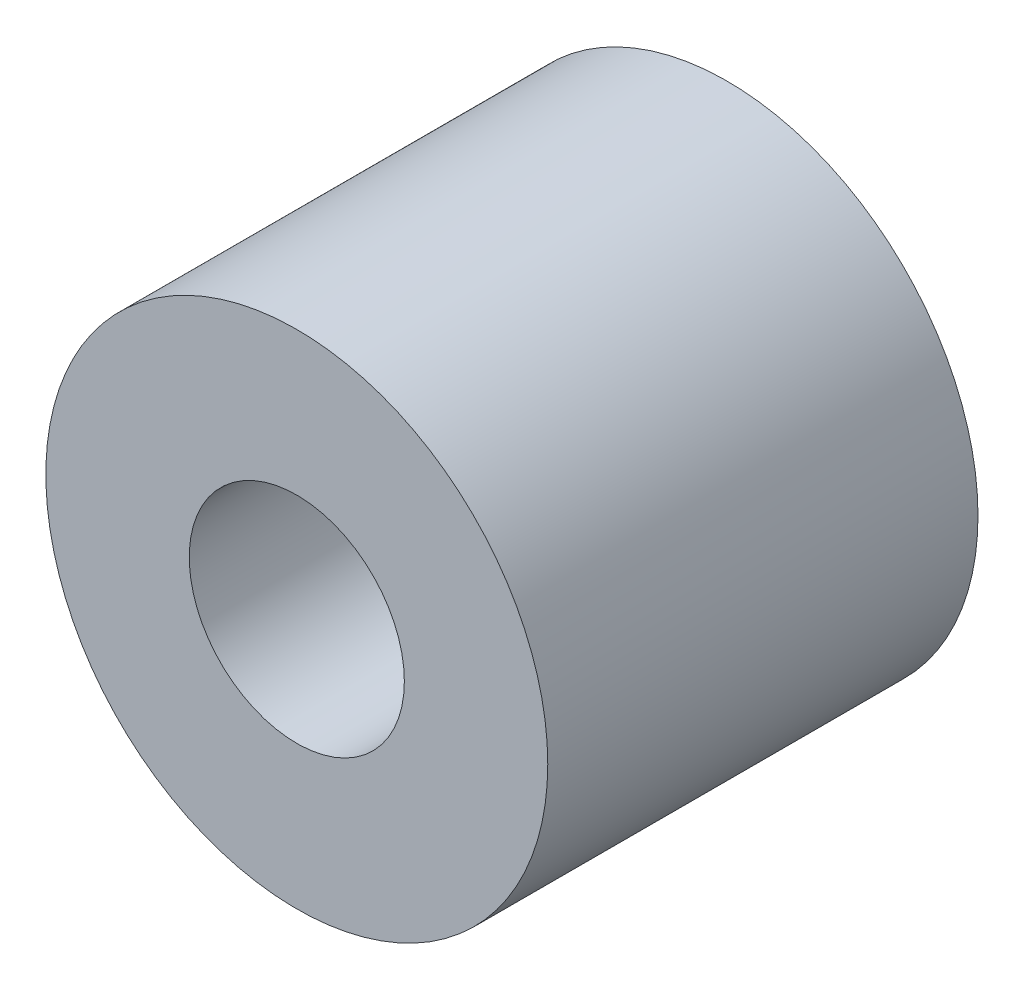
ISO-10303-21;
HEADER;
FILE_DESCRIPTION(('STEP AP214'),'2;1');
FILE_NAME('part.step','',(''),(''),'','','');
FILE_SCHEMA(('AUTOMOTIVE_DESIGN { 1 0 10303 214 1 1 1 1 }'));
ENDSEC;
DATA;
#1=APPLICATION_CONTEXT('core data for automotive mechanical design processes');
#2=APPLICATION_PROTOCOL_DEFINITION('international standard','automotive_design',2000,#1);
#3=PRODUCT_CONTEXT('',#1,'mechanical');
#4=PRODUCT('Part','Part','',(#3));
#5=PRODUCT_RELATED_PRODUCT_CATEGORY('part','',(#4));
#6=PRODUCT_DEFINITION_FORMATION('','',#4);
#7=PRODUCT_DEFINITION_CONTEXT('part definition',#1,'design');
#8=PRODUCT_DEFINITION('design','',#6,#7);
#9=PRODUCT_DEFINITION_SHAPE('','',#8);
#10=(LENGTH_UNIT() NAMED_UNIT(*) SI_UNIT(.MILLI.,.METRE.));
#11=(NAMED_UNIT(*) PLANE_ANGLE_UNIT() SI_UNIT($,.RADIAN.));
#12=(NAMED_UNIT(*) SI_UNIT($,.STERADIAN.) SOLID_ANGLE_UNIT());
#13=UNCERTAINTY_MEASURE_WITH_UNIT(LENGTH_MEASURE(1.E-05),#10,'distance_accuracy_value','');
#14=(GEOMETRIC_REPRESENTATION_CONTEXT(3) GLOBAL_UNCERTAINTY_ASSIGNED_CONTEXT((#13)) GLOBAL_UNIT_ASSIGNED_CONTEXT((#10,
#11,#12)) REPRESENTATION_CONTEXT('',''));
#15=CARTESIAN_POINT('',(0.,0.,0.));
#16=DIRECTION('',(0.,0.,1.));
#17=DIRECTION('',(1.,0.,0.));
#18=AXIS2_PLACEMENT_3D('',#15,#16,#17);
#19=CARTESIAN_POINT('',(0.,0.,4.7625));
#20=DIRECTION('',(0.,0.,1.));
#21=DIRECTION('',(1.,0.,0.));
#22=AXIS2_PLACEMENT_3D('',#19,#20,#21);
#23=PLANE('',#22);
#24=CARTESIAN_POINT('',(0.,0.,4.7625));
#25=DIRECTION('',(0.,0.,1.));
#26=DIRECTION('',(1.,0.,0.));
#27=AXIS2_PLACEMENT_3D('',#24,#25,#26);
#28=CIRCLE('',#27,2.778125);
#29=CARTESIAN_POINT('',(2.778125,0.,4.7625));
#30=VERTEX_POINT('',#29);
#31=EDGE_CURVE('E10',#30,#30,#28,.T.);
#32=ORIENTED_EDGE('',*,*,#31,.T.);
#33=EDGE_LOOP('',(#32));
#34=FACE_BOUND('',#33,.T.);
#35=CARTESIAN_POINT('',(0.,0.,4.7625));
#36=DIRECTION('',(0.,0.,1.));
#37=DIRECTION('',(1.,0.,0.));
#38=AXIS2_PLACEMENT_3D('',#35,#36,#37);
#39=CIRCLE('',#38,1.190625);
#40=CARTESIAN_POINT('',(1.190625,0.,4.7625));
#41=VERTEX_POINT('',#40);
#42=EDGE_CURVE('E42',#41,#41,#39,.T.);
#43=ORIENTED_EDGE('',*,*,#42,.F.);
#44=EDGE_LOOP('',(#43));
#45=FACE_BOUND('',#44,.T.);
#46=ADVANCED_FACE('F31',(#34,#45),#23,.T.);
#47=CARTESIAN_POINT('',(0.,0.,0.));
#48=DIRECTION('',(0.,0.,1.));
#49=DIRECTION('',(1.,0.,0.));
#50=AXIS2_PLACEMENT_3D('',#47,#48,#49);
#51=PLANE('',#50);
#52=CARTESIAN_POINT('',(0.,0.,0.));
#53=DIRECTION('',(0.,0.,1.));
#54=DIRECTION('',(1.,0.,0.));
#55=AXIS2_PLACEMENT_3D('',#52,#53,#54);
#56=CIRCLE('',#55,2.778125);
#57=CARTESIAN_POINT('',(2.778125,0.,0.));
#58=VERTEX_POINT('',#57);
#59=EDGE_CURVE('E35',#58,#58,#56,.T.);
#60=ORIENTED_EDGE('',*,*,#59,.F.);
#61=EDGE_LOOP('',(#60));
#62=FACE_BOUND('',#61,.T.);
#63=CARTESIAN_POINT('',(0.,0.,0.));
#64=DIRECTION('',(0.,0.,1.));
#65=DIRECTION('',(1.,0.,0.));
#66=AXIS2_PLACEMENT_3D('',#63,#64,#65);
#67=CIRCLE('',#66,1.190625);
#68=CARTESIAN_POINT('',(1.190625,0.,0.));
#69=VERTEX_POINT('',#68);
#70=EDGE_CURVE('E44',#69,#69,#67,.T.);
#71=ORIENTED_EDGE('',*,*,#70,.T.);
#72=EDGE_LOOP('',(#71));
#73=FACE_BOUND('',#72,.T.);
#74=ADVANCED_FACE('F54',(#62,#73),#51,.F.);
#75=CARTESIAN_POINT('',(0.,0.,4.7625));
#76=DIRECTION('',(0.,0.,-1.));
#77=DIRECTION('',(-1.,0.,0.));
#78=AXIS2_PLACEMENT_3D('',#75,#76,#77);
#79=CYLINDRICAL_SURFACE('',#78,2.778125);
#80=ORIENTED_EDGE('',*,*,#31,.F.);
#81=EDGE_LOOP('',(#80));
#82=FACE_BOUND('',#81,.T.);
#83=ORIENTED_EDGE('',*,*,#59,.T.);
#84=EDGE_LOOP('',(#83));
#85=FACE_BOUND('',#84,.T.);
#86=ADVANCED_FACE('F33',(#82,#85),#79,.T.);
#87=CARTESIAN_POINT('',(0.,0.,4.7625));
#88=DIRECTION('',(0.,0.,-1.));
#89=DIRECTION('',(-1.,0.,0.));
#90=AXIS2_PLACEMENT_3D('',#87,#88,#89);
#91=CYLINDRICAL_SURFACE('',#90,1.190625);
#92=ORIENTED_EDGE('',*,*,#42,.T.);
#93=EDGE_LOOP('',(#92));
#94=FACE_BOUND('',#93,.T.);
#95=ORIENTED_EDGE('',*,*,#70,.F.);
#96=EDGE_LOOP('',(#95));
#97=FACE_BOUND('',#96,.T.);
#98=ADVANCED_FACE('F50',(#94,#97),#91,.F.);
#99=CLOSED_SHELL('',(#46,#74,#86,#98));
#100=MANIFOLD_SOLID_BREP('B2',#99);
#101=ADVANCED_BREP_SHAPE_REPRESENTATION('',(#18,#100),#14);
#102=SHAPE_DEFINITION_REPRESENTATION(#9,#101);
ENDSEC;
END-ISO-10303-21;
